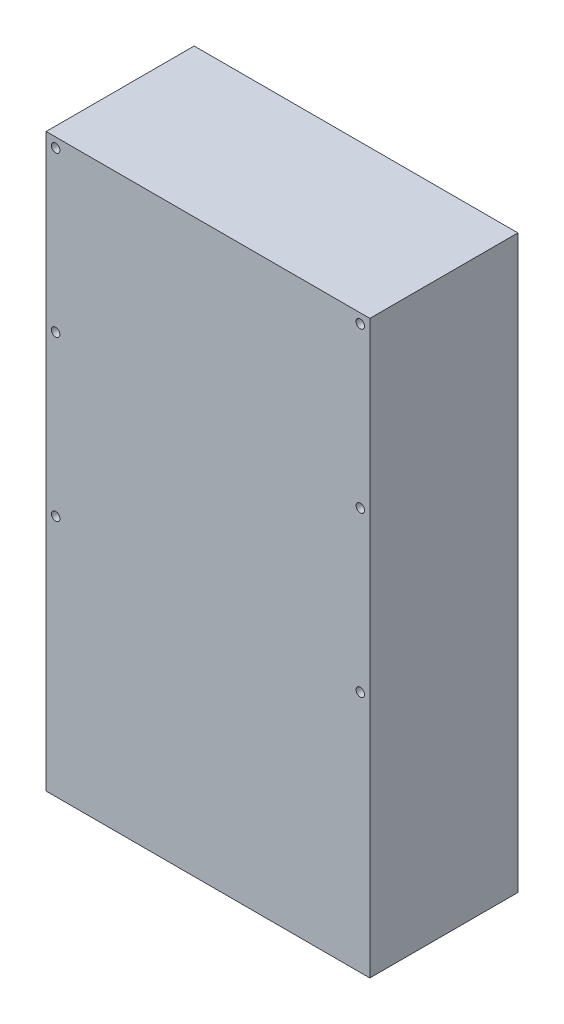
ISO-10303-21;
HEADER;
FILE_DESCRIPTION(('STEP AP214'),'2;1');
FILE_NAME('part.step','',(''),(''),'','','');
FILE_SCHEMA(('AUTOMOTIVE_DESIGN { 1 0 10303 214 1 1 1 1 }'));
ENDSEC;
DATA;
#1=APPLICATION_CONTEXT('core data for automotive mechanical design processes');
#2=APPLICATION_PROTOCOL_DEFINITION('international standard','automotive_design',2000,#1);
#3=PRODUCT_CONTEXT('',#1,'mechanical');
#4=PRODUCT('Part','Part','',(#3));
#5=PRODUCT_RELATED_PRODUCT_CATEGORY('part','',(#4));
#6=PRODUCT_DEFINITION_FORMATION('','',#4);
#7=PRODUCT_DEFINITION_CONTEXT('part definition',#1,'design');
#8=PRODUCT_DEFINITION('design','',#6,#7);
#9=PRODUCT_DEFINITION_SHAPE('','',#8);
#10=(LENGTH_UNIT() NAMED_UNIT(*) SI_UNIT(.MILLI.,.METRE.));
#11=(NAMED_UNIT(*) PLANE_ANGLE_UNIT() SI_UNIT($,.RADIAN.));
#12=(NAMED_UNIT(*) SI_UNIT($,.STERADIAN.) SOLID_ANGLE_UNIT());
#13=UNCERTAINTY_MEASURE_WITH_UNIT(LENGTH_MEASURE(1.E-05),#10,'distance_accuracy_value','');
#14=(GEOMETRIC_REPRESENTATION_CONTEXT(3) GLOBAL_UNCERTAINTY_ASSIGNED_CONTEXT((#13)) GLOBAL_UNIT_ASSIGNED_CONTEXT((#10,
#11,#12)) REPRESENTATION_CONTEXT('',''));
#15=CARTESIAN_POINT('',(0.,0.,0.));
#16=DIRECTION('',(0.,0.,1.));
#17=DIRECTION('',(1.,0.,0.));
#18=AXIS2_PLACEMENT_3D('',#15,#16,#17);
#19=CARTESIAN_POINT('',(-40.64,-152.858063314247,219.744946839597));
#20=DIRECTION('',(0.,0.,-1.));
#21=DIRECTION('',(-1.,0.,0.));
#22=AXIS2_PLACEMENT_3D('',#19,#20,#21);
#23=CYLINDRICAL_SURFACE('',#22,1.13029999999997);
#24=CARTESIAN_POINT('',(-40.64,-152.858063314247,0.));
#25=DIRECTION('',(0.,0.,1.));
#26=DIRECTION('',(-1.,0.,0.));
#27=AXIS2_PLACEMENT_3D('',#24,#25,#26);
#28=CIRCLE('',#27,1.13029999999997);
#29=CARTESIAN_POINT('',(-41.7702999999999,-152.858063314247,0.));
#30=VERTEX_POINT('',#29);
#31=EDGE_CURVE('E107',#30,#30,#28,.T.);
#32=ORIENTED_EDGE('',*,*,#31,.F.);
#33=EDGE_LOOP('',(#32));
#34=FACE_BOUND('',#33,.T.);
#35=CARTESIAN_POINT('',(-40.64,-152.858063314247,39.497));
#36=DIRECTION('',(0.,0.,1.));
#37=DIRECTION('',(1.,0.,0.));
#38=AXIS2_PLACEMENT_3D('',#35,#36,#37);
#39=CIRCLE('',#38,1.13029999999997);
#40=CARTESIAN_POINT('',(-39.5097,-152.858063314247,39.497));
#41=VERTEX_POINT('',#40);
#42=EDGE_CURVE('E154',#41,#41,#39,.T.);
#43=ORIENTED_EDGE('',*,*,#42,.T.);
#44=EDGE_LOOP('',(#43));
#45=FACE_BOUND('',#44,.T.);
#46=ADVANCED_FACE('F33',(#34,#45),#23,.F.);
#47=CARTESIAN_POINT('',(40.6399999999999,-110.313063314247,219.744946839597));
#48=DIRECTION('',(0.,0.,-1.));
#49=DIRECTION('',(-1.,0.,0.));
#50=AXIS2_PLACEMENT_3D('',#47,#48,#49);
#51=CYLINDRICAL_SURFACE('',#50,1.13029999999999);
#52=CARTESIAN_POINT('',(40.6399999999999,-110.313063314247,0.));
#53=DIRECTION('',(0.,0.,1.));
#54=DIRECTION('',(1.,0.,0.));
#55=AXIS2_PLACEMENT_3D('',#52,#53,#54);
#56=CIRCLE('',#55,1.13029999999999);
#57=CARTESIAN_POINT('',(41.7702999999999,-110.313063314247,0.));
#58=VERTEX_POINT('',#57);
#59=EDGE_CURVE('E113',#58,#58,#56,.T.);
#60=ORIENTED_EDGE('',*,*,#59,.F.);
#61=EDGE_LOOP('',(#60));
#62=FACE_BOUND('',#61,.T.);
#63=CARTESIAN_POINT('',(40.6399999999999,-110.313063314247,39.497));
#64=DIRECTION('',(0.,0.,1.));
#65=DIRECTION('',(1.,0.,0.));
#66=AXIS2_PLACEMENT_3D('',#63,#64,#65);
#67=CIRCLE('',#66,1.13029999999999);
#68=CARTESIAN_POINT('',(41.7702999999999,-110.313063314247,39.497));
#69=VERTEX_POINT('',#68);
#70=EDGE_CURVE('E97',#69,#69,#67,.T.);
#71=ORIENTED_EDGE('',*,*,#70,.T.);
#72=EDGE_LOOP('',(#71));
#73=FACE_BOUND('',#72,.T.);
#74=ADVANCED_FACE('F166',(#62,#73),#51,.F.);
#75=CARTESIAN_POINT('',(43.18,-217.628063314247,219.744946839597));
#76=DIRECTION('',(0.,1.,0.));
#77=DIRECTION('',(0.,0.,1.));
#78=AXIS2_PLACEMENT_3D('',#75,#76,#77);
#79=PLANE('',#78);
#80=DIRECTION('',(1.,0.,0.));
#81=VECTOR('',#80,1.);
#82=CARTESIAN_POINT('',(43.18,-217.628063314247,39.497));
#83=LINE('',#82,#81);
#84=CARTESIAN_POINT('',(-43.18,-217.628063314247,39.4970000000001));
#85=VERTEX_POINT('',#84);
#86=CARTESIAN_POINT('',(43.18,-217.628063314247,39.497));
#87=VERTEX_POINT('',#86);
#88=EDGE_CURVE('E78',#85,#87,#83,.T.);
#89=ORIENTED_EDGE('',*,*,#88,.F.);
#90=DIRECTION('',(0.,0.,-1.));
#91=VECTOR('',#90,1.);
#92=CARTESIAN_POINT('',(-43.18,-217.628063314247,219.744946839597));
#93=LINE('',#92,#91);
#94=CARTESIAN_POINT('',(-43.18,-217.628063314247,0.));
#95=VERTEX_POINT('',#94);
#96=EDGE_CURVE('E49',#85,#95,#93,.T.);
#97=ORIENTED_EDGE('',*,*,#96,.T.);
#98=DIRECTION('',(1.,0.,0.));
#99=VECTOR('',#98,1.);
#100=CARTESIAN_POINT('',(43.18,-217.628063314247,0.));
#101=LINE('',#100,#99);
#102=CARTESIAN_POINT('',(43.18,-217.628063314247,0.));
#103=VERTEX_POINT('',#102);
#104=EDGE_CURVE('E81',#95,#103,#101,.T.);
#105=ORIENTED_EDGE('',*,*,#104,.T.);
#106=DIRECTION('',(0.,0.,-1.));
#107=VECTOR('',#106,1.);
#108=CARTESIAN_POINT('',(43.18,-217.628063314247,219.744946839597));
#109=LINE('',#108,#107);
#110=EDGE_CURVE('E74',#87,#103,#109,.T.);
#111=ORIENTED_EDGE('',*,*,#110,.F.);
#112=EDGE_LOOP('',(#89,#97,#105,#111));
#113=FACE_BOUND('',#112,.T.);
#114=ADVANCED_FACE('F76',(#113),#79,.F.);
#115=CARTESIAN_POINT('',(-43.1799999999999,-65.2280633142473,219.744946839597));
#116=DIRECTION('',(1.,0.,0.));
#117=DIRECTION('',(0.,1.,0.));
#118=AXIS2_PLACEMENT_3D('',#115,#116,#117);
#119=PLANE('',#118);
#120=DIRECTION('',(0.,-1.,0.));
#121=VECTOR('',#120,1.);
#122=CARTESIAN_POINT('',(-43.1799999999999,-65.2280633142473,39.497));
#123=LINE('',#122,#121);
#124=CARTESIAN_POINT('',(-43.1799999999999,-65.2280633142473,39.4970000000001));
#125=VERTEX_POINT('',#124);
#126=EDGE_CURVE('E92',#125,#85,#123,.T.);
#127=ORIENTED_EDGE('',*,*,#126,.F.);
#128=DIRECTION('',(0.,0.,-1.));
#129=VECTOR('',#128,1.);
#130=CARTESIAN_POINT('',(-43.1799999999999,-65.2280633142473,219.744946839597));
#131=LINE('',#130,#129);
#132=CARTESIAN_POINT('',(-43.1799999999999,-65.2280633142473,0.));
#133=VERTEX_POINT('',#132);
#134=EDGE_CURVE('E42',#125,#133,#131,.T.);
#135=ORIENTED_EDGE('',*,*,#134,.T.);
#136=DIRECTION('',(0.,-1.,0.));
#137=VECTOR('',#136,1.);
#138=CARTESIAN_POINT('',(-43.1799999999999,-65.2280633142473,0.));
#139=LINE('',#138,#137);
#140=EDGE_CURVE('E124',#133,#95,#139,.T.);
#141=ORIENTED_EDGE('',*,*,#140,.T.);
#142=ORIENTED_EDGE('',*,*,#96,.F.);
#143=EDGE_LOOP('',(#127,#135,#141,#142));
#144=FACE_BOUND('',#143,.T.);
#145=ADVANCED_FACE('F128',(#144),#119,.F.);
#146=CARTESIAN_POINT('',(43.1799999999999,-65.2280633142473,219.744946839597));
#147=DIRECTION('',(0.,-1.,0.));
#148=DIRECTION('',(1.,0.,0.));
#149=AXIS2_PLACEMENT_3D('',#146,#147,#148);
#150=PLANE('',#149);
#151=DIRECTION('',(-1.,0.,0.));
#152=VECTOR('',#151,1.);
#153=CARTESIAN_POINT('',(43.1799999999999,-65.2280633142473,39.497));
#154=LINE('',#153,#152);
#155=CARTESIAN_POINT('',(43.1799999999999,-65.2280633142473,39.4970000000001));
#156=VERTEX_POINT('',#155);
#157=EDGE_CURVE('E56',#156,#125,#154,.T.);
#158=ORIENTED_EDGE('',*,*,#157,.F.);
#159=DIRECTION('',(0.,0.,-1.));
#160=VECTOR('',#159,1.);
#161=CARTESIAN_POINT('',(43.1799999999999,-65.2280633142473,219.744946839597));
#162=LINE('',#161,#160);
#163=CARTESIAN_POINT('',(43.1799999999999,-65.2280633142473,0.));
#164=VERTEX_POINT('',#163);
#165=EDGE_CURVE('E11',#156,#164,#162,.T.);
#166=ORIENTED_EDGE('',*,*,#165,.T.);
#167=DIRECTION('',(-1.,0.,0.));
#168=VECTOR('',#167,1.);
#169=CARTESIAN_POINT('',(43.1799999999999,-65.2280633142473,0.));
#170=LINE('',#169,#168);
#171=EDGE_CURVE('E121',#164,#133,#170,.T.);
#172=ORIENTED_EDGE('',*,*,#171,.T.);
#173=ORIENTED_EDGE('',*,*,#134,.F.);
#174=EDGE_LOOP('',(#158,#166,#172,#173));
#175=FACE_BOUND('',#174,.T.);
#176=ADVANCED_FACE('F131',(#175),#150,.F.);
#177=CARTESIAN_POINT('',(43.1799999999999,-65.2280633142473,219.744946839597));
#178=DIRECTION('',(-1.,0.,0.));
#179=DIRECTION('',(0.,-1.,0.));
#180=AXIS2_PLACEMENT_3D('',#177,#178,#179);
#181=PLANE('',#180);
#182=DIRECTION('',(0.,1.,0.));
#183=VECTOR('',#182,1.);
#184=CARTESIAN_POINT('',(43.1799999999999,-65.2280633142473,39.497));
#185=LINE('',#184,#183);
#186=EDGE_CURVE('E87',#87,#156,#185,.T.);
#187=ORIENTED_EDGE('',*,*,#186,.F.);
#188=ORIENTED_EDGE('',*,*,#110,.T.);
#189=DIRECTION('',(0.,1.,0.));
#190=VECTOR('',#189,1.);
#191=CARTESIAN_POINT('',(43.1799999999999,-65.2280633142473,0.));
#192=LINE('',#191,#190);
#193=EDGE_CURVE('E119',#103,#164,#192,.T.);
#194=ORIENTED_EDGE('',*,*,#193,.T.);
#195=ORIENTED_EDGE('',*,*,#165,.F.);
#196=EDGE_LOOP('',(#187,#188,#194,#195));
#197=FACE_BOUND('',#196,.T.);
#198=ADVANCED_FACE('F35',(#197),#181,.F.);
#199=CARTESIAN_POINT('',(40.6399999999999,-67.7680633142473,219.744946839597));
#200=DIRECTION('',(0.,0.,-1.));
#201=DIRECTION('',(-1.,0.,0.));
#202=AXIS2_PLACEMENT_3D('',#199,#200,#201);
#203=CYLINDRICAL_SURFACE('',#202,1.13029999999999);
#204=CARTESIAN_POINT('',(40.6399999999999,-67.7680633142473,0.));
#205=DIRECTION('',(0.,0.,1.));
#206=DIRECTION('',(1.,0.,0.));
#207=AXIS2_PLACEMENT_3D('',#204,#205,#206);
#208=CIRCLE('',#207,1.13029999999999);
#209=CARTESIAN_POINT('',(41.7702999999999,-67.7680633142473,0.));
#210=VERTEX_POINT('',#209);
#211=EDGE_CURVE('E116',#210,#210,#208,.T.);
#212=ORIENTED_EDGE('',*,*,#211,.F.);
#213=EDGE_LOOP('',(#212));
#214=FACE_BOUND('',#213,.T.);
#215=CARTESIAN_POINT('',(40.6399999999999,-67.7680633142473,39.497));
#216=DIRECTION('',(0.,0.,1.));
#217=DIRECTION('',(1.,0.,0.));
#218=AXIS2_PLACEMENT_3D('',#215,#216,#217);
#219=CIRCLE('',#218,1.13029999999999);
#220=CARTESIAN_POINT('',(41.7702999999999,-67.7680633142473,39.497));
#221=VERTEX_POINT('',#220);
#222=EDGE_CURVE('E93',#221,#221,#219,.T.);
#223=ORIENTED_EDGE('',*,*,#222,.T.);
#224=EDGE_LOOP('',(#223));
#225=FACE_BOUND('',#224,.T.);
#226=ADVANCED_FACE('F173',(#214,#225),#203,.F.);
#227=CARTESIAN_POINT('',(40.6399999999999,-152.858063314247,219.744946839597));
#228=DIRECTION('',(0.,0.,-1.));
#229=DIRECTION('',(-1.,0.,0.));
#230=AXIS2_PLACEMENT_3D('',#227,#228,#229);
#231=CYLINDRICAL_SURFACE('',#230,1.13029999999997);
#232=CARTESIAN_POINT('',(40.6399999999999,-152.858063314247,0.));
#233=DIRECTION('',(0.,0.,1.));
#234=DIRECTION('',(1.,0.,0.));
#235=AXIS2_PLACEMENT_3D('',#232,#233,#234);
#236=CIRCLE('',#235,1.13029999999997);
#237=CARTESIAN_POINT('',(41.7702999999999,-152.858063314247,0.));
#238=VERTEX_POINT('',#237);
#239=EDGE_CURVE('E110',#238,#238,#236,.T.);
#240=ORIENTED_EDGE('',*,*,#239,.F.);
#241=EDGE_LOOP('',(#240));
#242=FACE_BOUND('',#241,.T.);
#243=CARTESIAN_POINT('',(40.6399999999999,-152.858063314247,39.497));
#244=DIRECTION('',(0.,0.,1.));
#245=DIRECTION('',(1.,0.,0.));
#246=AXIS2_PLACEMENT_3D('',#243,#244,#245);
#247=CIRCLE('',#246,1.13029999999997);
#248=CARTESIAN_POINT('',(41.7702999999999,-152.858063314247,39.497));
#249=VERTEX_POINT('',#248);
#250=EDGE_CURVE('E159',#249,#249,#247,.T.);
#251=ORIENTED_EDGE('',*,*,#250,.T.);
#252=EDGE_LOOP('',(#251));
#253=FACE_BOUND('',#252,.T.);
#254=ADVANCED_FACE('F175',(#242,#253),#231,.F.);
#255=CARTESIAN_POINT('',(-40.6399999999999,-110.313063314247,219.744946839597));
#256=DIRECTION('',(0.,0.,-1.));
#257=DIRECTION('',(-1.,0.,0.));
#258=AXIS2_PLACEMENT_3D('',#255,#256,#257);
#259=CYLINDRICAL_SURFACE('',#258,1.13029999999999);
#260=CARTESIAN_POINT('',(-40.6399999999999,-110.313063314247,0.));
#261=DIRECTION('',(0.,0.,1.));
#262=DIRECTION('',(-1.,0.,0.));
#263=AXIS2_PLACEMENT_3D('',#260,#261,#262);
#264=CIRCLE('',#263,1.13029999999999);
#265=CARTESIAN_POINT('',(-41.7702999999999,-110.313063314247,0.));
#266=VERTEX_POINT('',#265);
#267=EDGE_CURVE('E104',#266,#266,#264,.T.);
#268=ORIENTED_EDGE('',*,*,#267,.F.);
#269=EDGE_LOOP('',(#268));
#270=FACE_BOUND('',#269,.T.);
#271=CARTESIAN_POINT('',(-40.6399999999999,-110.313063314247,39.497));
#272=DIRECTION('',(0.,0.,1.));
#273=DIRECTION('',(1.,0.,0.));
#274=AXIS2_PLACEMENT_3D('',#271,#272,#273);
#275=CIRCLE('',#274,1.13029999999999);
#276=CARTESIAN_POINT('',(-39.5097,-110.313063314247,39.497));
#277=VERTEX_POINT('',#276);
#278=EDGE_CURVE('E152',#277,#277,#275,.T.);
#279=ORIENTED_EDGE('',*,*,#278,.T.);
#280=EDGE_LOOP('',(#279));
#281=FACE_BOUND('',#280,.T.);
#282=ADVANCED_FACE('F137',(#270,#281),#259,.F.);
#283=CARTESIAN_POINT('',(0.,0.,0.));
#284=DIRECTION('',(0.,0.,-1.));
#285=DIRECTION('',(-1.,0.,0.));
#286=AXIS2_PLACEMENT_3D('',#283,#284,#285);
#287=PLANE('',#286);
#288=ORIENTED_EDGE('',*,*,#267,.T.);
#289=EDGE_LOOP('',(#288));
#290=FACE_BOUND('',#289,.T.);
#291=ORIENTED_EDGE('',*,*,#239,.T.);
#292=EDGE_LOOP('',(#291));
#293=FACE_BOUND('',#292,.T.);
#294=ORIENTED_EDGE('',*,*,#211,.T.);
#295=EDGE_LOOP('',(#294));
#296=FACE_BOUND('',#295,.T.);
#297=ORIENTED_EDGE('',*,*,#193,.F.);
#298=ORIENTED_EDGE('',*,*,#104,.F.);
#299=ORIENTED_EDGE('',*,*,#140,.F.);
#300=ORIENTED_EDGE('',*,*,#171,.F.);
#301=EDGE_LOOP('',(#297,#298,#299,#300));
#302=FACE_BOUND('',#301,.T.);
#303=ORIENTED_EDGE('',*,*,#59,.T.);
#304=EDGE_LOOP('',(#303));
#305=FACE_BOUND('',#304,.T.);
#306=ORIENTED_EDGE('',*,*,#31,.T.);
#307=EDGE_LOOP('',(#306));
#308=FACE_BOUND('',#307,.T.);
#309=CARTESIAN_POINT('',(-40.6399999999999,-67.7680633142473,0.));
#310=DIRECTION('',(0.,0.,1.));
#311=DIRECTION('',(-1.,0.,0.));
#312=AXIS2_PLACEMENT_3D('',#309,#310,#311);
#313=CIRCLE('',#312,1.13029999999999);
#314=CARTESIAN_POINT('',(-41.7702999999999,-67.7680633142473,0.));
#315=VERTEX_POINT('',#314);
#316=EDGE_CURVE('E89',#315,#315,#313,.T.);
#317=ORIENTED_EDGE('',*,*,#316,.T.);
#318=EDGE_LOOP('',(#317));
#319=FACE_BOUND('',#318,.T.);
#320=ADVANCED_FACE('F133',(#290,#293,#296,#302,#305,#308,#319),#287,.T.);
#321=CARTESIAN_POINT('',(-40.6399999999999,-67.7680633142473,219.744946839597));
#322=DIRECTION('',(0.,0.,-1.));
#323=DIRECTION('',(-1.,0.,0.));
#324=AXIS2_PLACEMENT_3D('',#321,#322,#323);
#325=CYLINDRICAL_SURFACE('',#324,1.13029999999999);
#326=ORIENTED_EDGE('',*,*,#316,.F.);
#327=EDGE_LOOP('',(#326));
#328=FACE_BOUND('',#327,.T.);
#329=CARTESIAN_POINT('',(-40.6399999999999,-67.7680633142473,39.497));
#330=DIRECTION('',(0.,0.,1.));
#331=DIRECTION('',(1.,0.,0.));
#332=AXIS2_PLACEMENT_3D('',#329,#330,#331);
#333=CIRCLE('',#332,1.13029999999999);
#334=CARTESIAN_POINT('',(-39.5096999999999,-67.7680633142473,39.497));
#335=VERTEX_POINT('',#334);
#336=EDGE_CURVE('E37',#335,#335,#333,.T.);
#337=ORIENTED_EDGE('',*,*,#336,.T.);
#338=EDGE_LOOP('',(#337));
#339=FACE_BOUND('',#338,.T.);
#340=ADVANCED_FACE('F136',(#328,#339),#325,.F.);
#341=CARTESIAN_POINT('',(0.,0.,39.497));
#342=DIRECTION('',(0.,0.,1.));
#343=DIRECTION('',(0.,1.,0.));
#344=AXIS2_PLACEMENT_3D('',#341,#342,#343);
#345=PLANE('',#344);
#346=ORIENTED_EDGE('',*,*,#336,.F.);
#347=EDGE_LOOP('',(#346));
#348=FACE_BOUND('',#347,.T.);
#349=ORIENTED_EDGE('',*,*,#278,.F.);
#350=EDGE_LOOP('',(#349));
#351=FACE_BOUND('',#350,.T.);
#352=ORIENTED_EDGE('',*,*,#42,.F.);
#353=EDGE_LOOP('',(#352));
#354=FACE_BOUND('',#353,.T.);
#355=ORIENTED_EDGE('',*,*,#250,.F.);
#356=EDGE_LOOP('',(#355));
#357=FACE_BOUND('',#356,.T.);
#358=ORIENTED_EDGE('',*,*,#70,.F.);
#359=EDGE_LOOP('',(#358));
#360=FACE_BOUND('',#359,.T.);
#361=ORIENTED_EDGE('',*,*,#222,.F.);
#362=EDGE_LOOP('',(#361));
#363=FACE_BOUND('',#362,.T.);
#364=ORIENTED_EDGE('',*,*,#88,.T.);
#365=ORIENTED_EDGE('',*,*,#186,.T.);
#366=ORIENTED_EDGE('',*,*,#157,.T.);
#367=ORIENTED_EDGE('',*,*,#126,.T.);
#368=EDGE_LOOP('',(#364,#365,#366,#367));
#369=FACE_BOUND('',#368,.T.);
#370=ADVANCED_FACE('F91',(#348,#351,#354,#357,#360,#363,#369),#345,.T.);
#371=CLOSED_SHELL('',(#46,#74,#114,#145,#176,#198,#226,#254,#282,#320,#340,#370));
#372=MANIFOLD_SOLID_BREP('B2',#371);
#373=ADVANCED_BREP_SHAPE_REPRESENTATION('',(#18,#372),#14);
#374=SHAPE_DEFINITION_REPRESENTATION(#9,#373);
ENDSEC;
END-ISO-10303-21;
